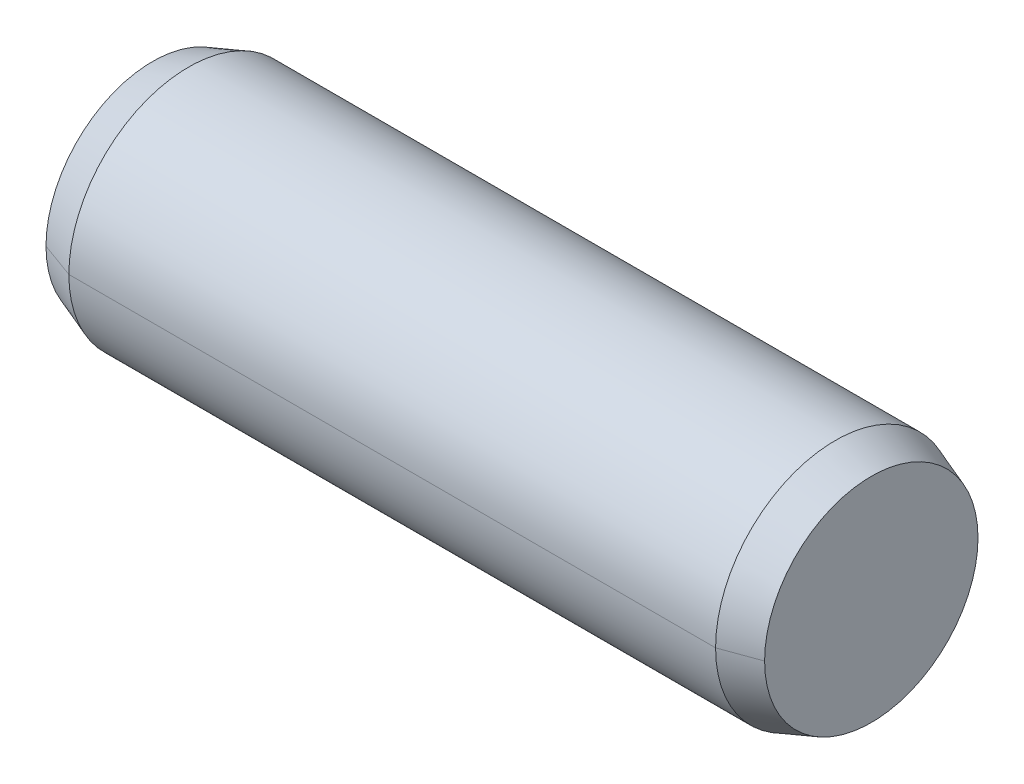
ISO-10303-21;
HEADER;
FILE_DESCRIPTION(('STEP AP214'),'2;1');
FILE_NAME('part.step','',(''),(''),'','','');
FILE_SCHEMA(('AUTOMOTIVE_DESIGN { 1 0 10303 214 1 1 1 1 }'));
ENDSEC;
DATA;
#1=APPLICATION_CONTEXT('core data for automotive mechanical design processes');
#2=APPLICATION_PROTOCOL_DEFINITION('international standard','automotive_design',2000,#1);
#3=PRODUCT_CONTEXT('',#1,'mechanical');
#4=PRODUCT('Part','Part','',(#3));
#5=PRODUCT_RELATED_PRODUCT_CATEGORY('part','',(#4));
#6=PRODUCT_DEFINITION_FORMATION('','',#4);
#7=PRODUCT_DEFINITION_CONTEXT('part definition',#1,'design');
#8=PRODUCT_DEFINITION('design','',#6,#7);
#9=PRODUCT_DEFINITION_SHAPE('','',#8);
#10=(LENGTH_UNIT() NAMED_UNIT(*) SI_UNIT(.MILLI.,.METRE.));
#11=(NAMED_UNIT(*) PLANE_ANGLE_UNIT() SI_UNIT($,.RADIAN.));
#12=(NAMED_UNIT(*) SI_UNIT($,.STERADIAN.) SOLID_ANGLE_UNIT());
#13=UNCERTAINTY_MEASURE_WITH_UNIT(LENGTH_MEASURE(1.E-05),#10,'distance_accuracy_value','');
#14=(GEOMETRIC_REPRESENTATION_CONTEXT(3) GLOBAL_UNCERTAINTY_ASSIGNED_CONTEXT((#13)) GLOBAL_UNIT_ASSIGNED_CONTEXT((#10,
#11,#12)) REPRESENTATION_CONTEXT('',''));
#15=CARTESIAN_POINT('',(0.,0.,0.));
#16=DIRECTION('',(0.,0.,1.));
#17=DIRECTION('',(1.,0.,0.));
#18=AXIS2_PLACEMENT_3D('',#15,#16,#17);
#19=CARTESIAN_POINT('',(-3.,0.,0.));
#20=DIRECTION('',(1.,0.,0.));
#21=DIRECTION('',(0.,1.,0.));
#22=AXIS2_PLACEMENT_3D('',#19,#20,#21);
#23=PLANE('',#22);
#24=CARTESIAN_POINT('',(-3.,0.,0.));
#25=DIRECTION('',(-1.,0.,0.));
#26=DIRECTION('',(0.,0.,1.));
#27=AXIS2_PLACEMENT_3D('',#24,#25,#26);
#28=CIRCLE('',#27,0.890908929720139);
#29=CARTESIAN_POINT('',(-3.,0.,-0.890908929720139));
#30=VERTEX_POINT('',#29);
#31=CARTESIAN_POINT('',(-3.,0.,0.890908929720139));
#32=VERTEX_POINT('',#31);
#33=EDGE_CURVE('E11',#30,#32,#28,.T.);
#34=ORIENTED_EDGE('',*,*,#33,.T.);
#35=CARTESIAN_POINT('',(-3.,0.,0.));
#36=DIRECTION('',(-1.,0.,0.));
#37=DIRECTION('',(0.,0.,1.));
#38=AXIS2_PLACEMENT_3D('',#35,#36,#37);
#39=CIRCLE('',#38,0.890908929720139);
#40=EDGE_CURVE('E109',#32,#30,#39,.T.);
#41=ORIENTED_EDGE('',*,*,#40,.T.);
#42=EDGE_LOOP('',(#34,#41));
#43=FACE_BOUND('',#42,.T.);
#44=ADVANCED_FACE('F16',(#43),#23,.F.);
#45=CARTESIAN_POINT('',(-3.,0.,0.));
#46=DIRECTION('',(1.,0.,0.));
#47=DIRECTION('',(0.,0.,-1.));
#48=AXIS2_PLACEMENT_3D('',#45,#46,#47);
#49=CONICAL_SURFACE('',#48,0.890908929720139,0.349065850398866);
#50=DIRECTION('',(0.939692620785908,0.,0.342020143325669));
#51=VECTOR('',#50,1.);
#52=CARTESIAN_POINT('',(-3.,0.,0.890908929720139));
#53=LINE('',#52,#51);
#54=CARTESIAN_POINT('',(-2.7,0.,1.0001));
#55=VERTEX_POINT('',#54);
#56=EDGE_CURVE('E89',#32,#55,#53,.T.);
#57=ORIENTED_EDGE('',*,*,#56,.F.);
#58=ORIENTED_EDGE('',*,*,#33,.F.);
#59=DIRECTION('',(0.939692620785908,0.,-0.342020143325669));
#60=VECTOR('',#59,1.);
#61=CARTESIAN_POINT('',(-3.,0.,-0.890908929720139));
#62=LINE('',#61,#60);
#63=CARTESIAN_POINT('',(-2.7,0.,-1.0001));
#64=VERTEX_POINT('',#63);
#65=EDGE_CURVE('E91',#30,#64,#62,.T.);
#66=ORIENTED_EDGE('',*,*,#65,.T.);
#67=CARTESIAN_POINT('',(-2.7,0.,0.));
#68=DIRECTION('',(-1.,0.,0.));
#69=DIRECTION('',(0.,0.,1.));
#70=AXIS2_PLACEMENT_3D('',#67,#68,#69);
#71=CIRCLE('',#70,1.0001);
#72=EDGE_CURVE('E86',#64,#55,#71,.T.);
#73=ORIENTED_EDGE('',*,*,#72,.T.);
#74=EDGE_LOOP('',(#57,#58,#66,#73));
#75=FACE_BOUND('',#74,.T.);
#76=ADVANCED_FACE('F87',(#75),#49,.T.);
#77=CARTESIAN_POINT('',(3.,0.,0.));
#78=DIRECTION('',(1.,0.,0.));
#79=DIRECTION('',(0.,1.,0.));
#80=AXIS2_PLACEMENT_3D('',#77,#78,#79);
#81=PLANE('',#80);
#82=CARTESIAN_POINT('',(3.,0.,0.));
#83=DIRECTION('',(-1.,0.,0.));
#84=DIRECTION('',(0.,0.,1.));
#85=AXIS2_PLACEMENT_3D('',#82,#83,#84);
#86=CIRCLE('',#85,0.890908929720139);
#87=CARTESIAN_POINT('',(3.,0.,0.890908929720139));
#88=VERTEX_POINT('',#87);
#89=CARTESIAN_POINT('',(3.,0.,-0.890908929720139));
#90=VERTEX_POINT('',#89);
#91=EDGE_CURVE('E122',#88,#90,#86,.T.);
#92=ORIENTED_EDGE('',*,*,#91,.F.);
#93=CARTESIAN_POINT('',(3.,0.,0.));
#94=DIRECTION('',(-1.,0.,0.));
#95=DIRECTION('',(0.,0.,1.));
#96=AXIS2_PLACEMENT_3D('',#93,#94,#95);
#97=CIRCLE('',#96,0.890908929720139);
#98=EDGE_CURVE('E27',#90,#88,#97,.T.);
#99=ORIENTED_EDGE('',*,*,#98,.F.);
#100=EDGE_LOOP('',(#92,#99));
#101=FACE_BOUND('',#100,.T.);
#102=ADVANCED_FACE('F188',(#101),#81,.T.);
#103=CARTESIAN_POINT('',(2.7,0.,0.));
#104=DIRECTION('',(-1.,0.,0.));
#105=DIRECTION('',(0.,0.,1.));
#106=AXIS2_PLACEMENT_3D('',#103,#104,#105);
#107=CONICAL_SURFACE('',#106,1.0001,0.349065850398866);
#108=DIRECTION('',(-0.939692620785908,0.,-0.342020143325669));
#109=VECTOR('',#108,1.);
#110=CARTESIAN_POINT('',(2.7,0.,-1.0001));
#111=LINE('',#110,#109);
#112=CARTESIAN_POINT('',(2.7,0.,-1.0001));
#113=VERTEX_POINT('',#112);
#114=EDGE_CURVE('E117',#90,#113,#111,.T.);
#115=ORIENTED_EDGE('',*,*,#114,.F.);
#116=ORIENTED_EDGE('',*,*,#98,.T.);
#117=DIRECTION('',(-0.939692620785908,0.,0.342020143325669));
#118=VECTOR('',#117,1.);
#119=CARTESIAN_POINT('',(2.7,0.,1.0001));
#120=LINE('',#119,#118);
#121=CARTESIAN_POINT('',(2.7,0.,1.0001));
#122=VERTEX_POINT('',#121);
#123=EDGE_CURVE('E128',#88,#122,#120,.T.);
#124=ORIENTED_EDGE('',*,*,#123,.T.);
#125=CARTESIAN_POINT('',(2.7,0.,0.));
#126=DIRECTION('',(-1.,0.,0.));
#127=DIRECTION('',(0.,0.,1.));
#128=AXIS2_PLACEMENT_3D('',#125,#126,#127);
#129=CIRCLE('',#128,1.0001);
#130=EDGE_CURVE('E20',#113,#122,#129,.T.);
#131=ORIENTED_EDGE('',*,*,#130,.F.);
#132=EDGE_LOOP('',(#115,#116,#124,#131));
#133=FACE_BOUND('',#132,.T.);
#134=ADVANCED_FACE('F141',(#133),#107,.T.);
#135=CARTESIAN_POINT('',(3.,0.,0.));
#136=DIRECTION('',(-1.,0.,0.));
#137=DIRECTION('',(0.,0.,1.));
#138=AXIS2_PLACEMENT_3D('',#135,#136,#137);
#139=CYLINDRICAL_SURFACE('',#138,1.0001);
#140=DIRECTION('',(-1.,0.,0.));
#141=VECTOR('',#140,1.);
#142=CARTESIAN_POINT('',(3.,0.,-1.0001));
#143=LINE('',#142,#141);
#144=EDGE_CURVE('E102',#113,#64,#143,.T.);
#145=ORIENTED_EDGE('',*,*,#144,.F.);
#146=ORIENTED_EDGE('',*,*,#130,.T.);
#147=DIRECTION('',(-1.,0.,0.));
#148=VECTOR('',#147,1.);
#149=CARTESIAN_POINT('',(3.,0.,1.0001));
#150=LINE('',#149,#148);
#151=EDGE_CURVE('E96',#122,#55,#150,.T.);
#152=ORIENTED_EDGE('',*,*,#151,.T.);
#153=ORIENTED_EDGE('',*,*,#72,.F.);
#154=EDGE_LOOP('',(#145,#146,#152,#153));
#155=FACE_BOUND('',#154,.T.);
#156=ADVANCED_FACE('F98',(#155),#139,.T.);
#157=CARTESIAN_POINT('',(3.,0.,0.));
#158=DIRECTION('',(-1.,0.,0.));
#159=DIRECTION('',(0.,0.,1.));
#160=AXIS2_PLACEMENT_3D('',#157,#158,#159);
#161=CYLINDRICAL_SURFACE('',#160,1.0001);
#162=CARTESIAN_POINT('',(2.7,0.,0.));
#163=DIRECTION('',(-1.,0.,0.));
#164=DIRECTION('',(0.,0.,1.));
#165=AXIS2_PLACEMENT_3D('',#162,#163,#164);
#166=CIRCLE('',#165,1.0001);
#167=EDGE_CURVE('E121',#122,#113,#166,.T.);
#168=ORIENTED_EDGE('',*,*,#167,.T.);
#169=ORIENTED_EDGE('',*,*,#144,.T.);
#170=CARTESIAN_POINT('',(-2.7,0.,0.));
#171=DIRECTION('',(-1.,0.,0.));
#172=DIRECTION('',(0.,0.,1.));
#173=AXIS2_PLACEMENT_3D('',#170,#171,#172);
#174=CIRCLE('',#173,1.0001);
#175=EDGE_CURVE('E104',#55,#64,#174,.T.);
#176=ORIENTED_EDGE('',*,*,#175,.F.);
#177=ORIENTED_EDGE('',*,*,#151,.F.);
#178=EDGE_LOOP('',(#168,#169,#176,#177));
#179=FACE_BOUND('',#178,.T.);
#180=ADVANCED_FACE('F105',(#179),#161,.T.);
#181=CARTESIAN_POINT('',(2.7,0.,0.));
#182=DIRECTION('',(-1.,0.,0.));
#183=DIRECTION('',(0.,0.,1.));
#184=AXIS2_PLACEMENT_3D('',#181,#182,#183);
#185=CONICAL_SURFACE('',#184,1.0001,0.349065850398866);
#186=ORIENTED_EDGE('',*,*,#91,.T.);
#187=ORIENTED_EDGE('',*,*,#114,.T.);
#188=ORIENTED_EDGE('',*,*,#167,.F.);
#189=ORIENTED_EDGE('',*,*,#123,.F.);
#190=EDGE_LOOP('',(#186,#187,#188,#189));
#191=FACE_BOUND('',#190,.T.);
#192=ADVANCED_FACE('F140',(#191),#185,.T.);
#193=CARTESIAN_POINT('',(-3.,0.,0.));
#194=DIRECTION('',(1.,0.,0.));
#195=DIRECTION('',(0.,0.,-1.));
#196=AXIS2_PLACEMENT_3D('',#193,#194,#195);
#197=CONICAL_SURFACE('',#196,0.890908929720139,0.349065850398866);
#198=ORIENTED_EDGE('',*,*,#40,.F.);
#199=ORIENTED_EDGE('',*,*,#56,.T.);
#200=ORIENTED_EDGE('',*,*,#175,.T.);
#201=ORIENTED_EDGE('',*,*,#65,.F.);
#202=EDGE_LOOP('',(#198,#199,#200,#201));
#203=FACE_BOUND('',#202,.T.);
#204=ADVANCED_FACE('F18',(#203),#197,.T.);
#205=CLOSED_SHELL('',(#44,#76,#102,#134,#156,#180,#192,#204));
#206=MANIFOLD_SOLID_BREP('B1',#205);
#207=ADVANCED_BREP_SHAPE_REPRESENTATION('',(#18,#206),#14);
#208=SHAPE_DEFINITION_REPRESENTATION(#9,#207);
ENDSEC;
END-ISO-10303-21;
